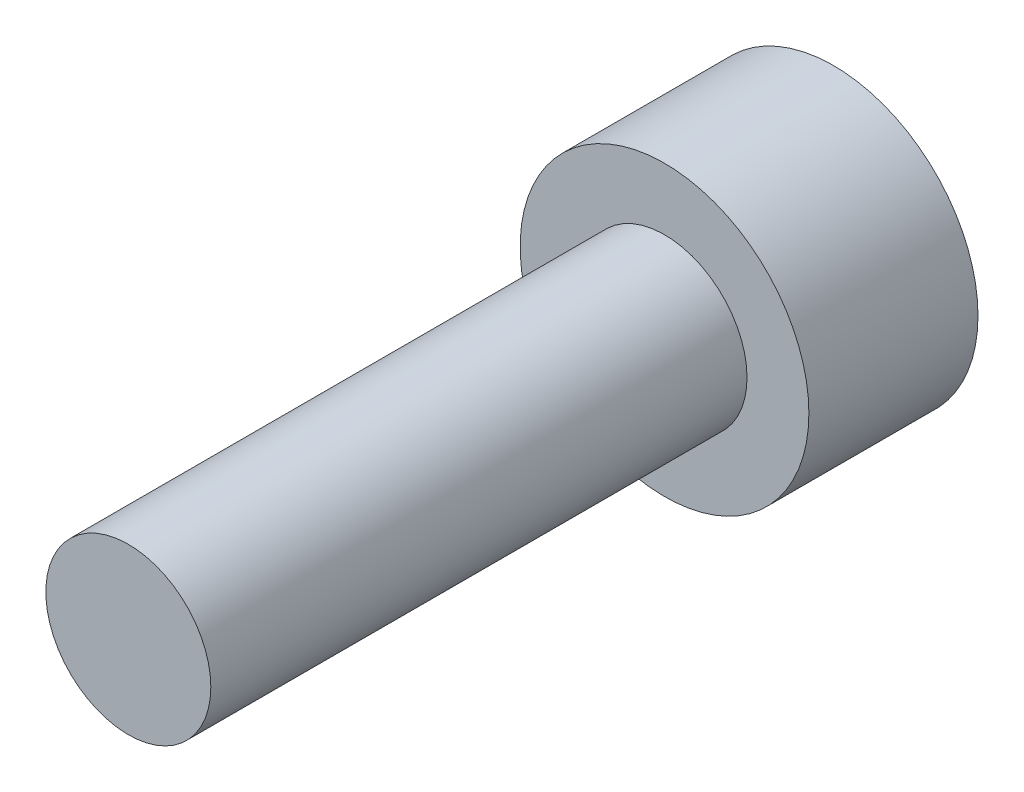
ISO-10303-21;
HEADER;
FILE_DESCRIPTION(('STEP AP214'),'2;1');
FILE_NAME('part.step','',(''),(''),'','','');
FILE_SCHEMA(('AUTOMOTIVE_DESIGN { 1 0 10303 214 1 1 1 1 }'));
ENDSEC;
DATA;
#1=APPLICATION_CONTEXT('core data for automotive mechanical design processes');
#2=APPLICATION_PROTOCOL_DEFINITION('international standard','automotive_design',2000,#1);
#3=PRODUCT_CONTEXT('',#1,'mechanical');
#4=PRODUCT('Part','Part','',(#3));
#5=PRODUCT_RELATED_PRODUCT_CATEGORY('part','',(#4));
#6=PRODUCT_DEFINITION_FORMATION('','',#4);
#7=PRODUCT_DEFINITION_CONTEXT('part definition',#1,'design');
#8=PRODUCT_DEFINITION('design','',#6,#7);
#9=PRODUCT_DEFINITION_SHAPE('','',#8);
#10=(LENGTH_UNIT() NAMED_UNIT(*) SI_UNIT(.MILLI.,.METRE.));
#11=(NAMED_UNIT(*) PLANE_ANGLE_UNIT() SI_UNIT($,.RADIAN.));
#12=(NAMED_UNIT(*) SI_UNIT($,.STERADIAN.) SOLID_ANGLE_UNIT());
#13=UNCERTAINTY_MEASURE_WITH_UNIT(LENGTH_MEASURE(1.E-05),#10,'distance_accuracy_value','');
#14=(GEOMETRIC_REPRESENTATION_CONTEXT(3) GLOBAL_UNCERTAINTY_ASSIGNED_CONTEXT((#13)) GLOBAL_UNIT_ASSIGNED_CONTEXT((#10,
#11,#12)) REPRESENTATION_CONTEXT('',''));
#15=CARTESIAN_POINT('',(0.,0.,0.));
#16=DIRECTION('',(0.,0.,1.));
#17=DIRECTION('',(1.,0.,0.));
#18=AXIS2_PLACEMENT_3D('',#15,#16,#17);
#19=CARTESIAN_POINT('',(0.,0.,4.1));
#20=DIRECTION('',(0.,0.,-1.));
#21=DIRECTION('',(-1.,0.,0.));
#22=AXIS2_PLACEMENT_3D('',#19,#20,#21);
#23=CYLINDRICAL_SURFACE('',#22,3.5);
#24=CARTESIAN_POINT('',(0.,0.,4.1));
#25=DIRECTION('',(0.,0.,1.));
#26=DIRECTION('',(1.,0.,0.));
#27=AXIS2_PLACEMENT_3D('',#24,#25,#26);
#28=CIRCLE('',#27,3.5);
#29=CARTESIAN_POINT('',(3.5,0.,4.1));
#30=VERTEX_POINT('',#29);
#31=EDGE_CURVE('E40',#30,#30,#28,.T.);
#32=ORIENTED_EDGE('',*,*,#31,.F.);
#33=EDGE_LOOP('',(#32));
#34=FACE_BOUND('',#33,.T.);
#35=CARTESIAN_POINT('',(0.,0.,0.));
#36=DIRECTION('',(0.,0.,1.));
#37=DIRECTION('',(1.,0.,0.));
#38=AXIS2_PLACEMENT_3D('',#35,#36,#37);
#39=CIRCLE('',#38,3.5);
#40=CARTESIAN_POINT('',(3.5,0.,0.));
#41=VERTEX_POINT('',#40);
#42=EDGE_CURVE('E36',#41,#41,#39,.T.);
#43=ORIENTED_EDGE('',*,*,#42,.T.);
#44=EDGE_LOOP('',(#43));
#45=FACE_BOUND('',#44,.T.);
#46=ADVANCED_FACE('F33',(#34,#45),#23,.T.);
#47=CARTESIAN_POINT('',(0.,0.,4.1));
#48=DIRECTION('',(0.,0.,1.));
#49=DIRECTION('',(1.,0.,0.));
#50=AXIS2_PLACEMENT_3D('',#47,#48,#49);
#51=PLANE('',#50);
#52=CARTESIAN_POINT('',(0.,0.,4.1));
#53=DIRECTION('',(0.,0.,1.));
#54=DIRECTION('',(1.,0.,0.));
#55=AXIS2_PLACEMENT_3D('',#52,#53,#54);
#56=CIRCLE('',#55,2.);
#57=CARTESIAN_POINT('',(2.,0.,4.1));
#58=VERTEX_POINT('',#57);
#59=EDGE_CURVE('E10',#58,#58,#56,.T.);
#60=ORIENTED_EDGE('',*,*,#59,.F.);
#61=EDGE_LOOP('',(#60));
#62=FACE_BOUND('',#61,.T.);
#63=ORIENTED_EDGE('',*,*,#31,.T.);
#64=EDGE_LOOP('',(#63));
#65=FACE_BOUND('',#64,.T.);
#66=ADVANCED_FACE('F57',(#62,#65),#51,.T.);
#67=CARTESIAN_POINT('',(0.,0.,0.));
#68=DIRECTION('',(0.,0.,1.));
#69=DIRECTION('',(1.,0.,0.));
#70=AXIS2_PLACEMENT_3D('',#67,#68,#69);
#71=PLANE('',#70);
#72=ORIENTED_EDGE('',*,*,#42,.F.);
#73=EDGE_LOOP('',(#72));
#74=FACE_BOUND('',#73,.T.);
#75=ADVANCED_FACE('F54',(#74),#71,.F.);
#76=CARTESIAN_POINT('',(0.,0.,17.1));
#77=DIRECTION('',(0.,0.,-1.));
#78=DIRECTION('',(-1.,0.,0.));
#79=AXIS2_PLACEMENT_3D('',#76,#77,#78);
#80=CYLINDRICAL_SURFACE('',#79,2.);
#81=CARTESIAN_POINT('',(0.,0.,17.1));
#82=DIRECTION('',(0.,0.,1.));
#83=DIRECTION('',(1.,0.,0.));
#84=AXIS2_PLACEMENT_3D('',#81,#82,#83);
#85=CIRCLE('',#84,2.);
#86=CARTESIAN_POINT('',(2.,0.,17.1));
#87=VERTEX_POINT('',#86);
#88=EDGE_CURVE('E46',#87,#87,#85,.T.);
#89=ORIENTED_EDGE('',*,*,#88,.F.);
#90=EDGE_LOOP('',(#89));
#91=FACE_BOUND('',#90,.T.);
#92=ORIENTED_EDGE('',*,*,#59,.T.);
#93=EDGE_LOOP('',(#92));
#94=FACE_BOUND('',#93,.T.);
#95=ADVANCED_FACE('F56',(#91,#94),#80,.T.);
#96=CARTESIAN_POINT('',(0.,0.,17.1));
#97=DIRECTION('',(0.,0.,1.));
#98=DIRECTION('',(1.,0.,0.));
#99=AXIS2_PLACEMENT_3D('',#96,#97,#98);
#100=PLANE('',#99);
#101=ORIENTED_EDGE('',*,*,#88,.T.);
#102=EDGE_LOOP('',(#101));
#103=FACE_BOUND('',#102,.T.);
#104=ADVANCED_FACE('F62',(#103),#100,.T.);
#105=CLOSED_SHELL('',(#46,#66,#75,#95,#104));
#106=MANIFOLD_SOLID_BREP('B2',#105);
#107=ADVANCED_BREP_SHAPE_REPRESENTATION('',(#18,#106),#14);
#108=SHAPE_DEFINITION_REPRESENTATION(#9,#107);
ENDSEC;
END-ISO-10303-21;
